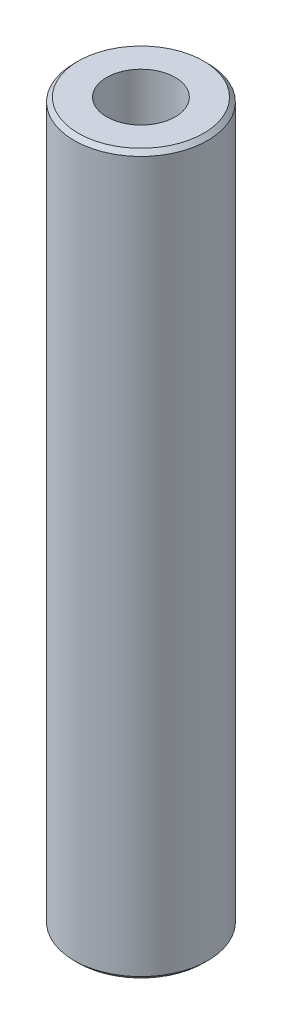
ISO-10303-21;
HEADER;
FILE_DESCRIPTION(('STEP AP214'),'2;1');
FILE_NAME('part.step','',(''),(''),'','','');
FILE_SCHEMA(('AUTOMOTIVE_DESIGN { 1 0 10303 214 1 1 1 1 }'));
ENDSEC;
DATA;
#1=APPLICATION_CONTEXT('core data for automotive mechanical design processes');
#2=APPLICATION_PROTOCOL_DEFINITION('international standard','automotive_design',2000,#1);
#3=PRODUCT_CONTEXT('',#1,'mechanical');
#4=PRODUCT('Part','Part','',(#3));
#5=PRODUCT_RELATED_PRODUCT_CATEGORY('part','',(#4));
#6=PRODUCT_DEFINITION_FORMATION('','',#4);
#7=PRODUCT_DEFINITION_CONTEXT('part definition',#1,'design');
#8=PRODUCT_DEFINITION('design','',#6,#7);
#9=PRODUCT_DEFINITION_SHAPE('','',#8);
#10=(LENGTH_UNIT() NAMED_UNIT(*) SI_UNIT(.MILLI.,.METRE.));
#11=(NAMED_UNIT(*) PLANE_ANGLE_UNIT() SI_UNIT($,.RADIAN.));
#12=(NAMED_UNIT(*) SI_UNIT($,.STERADIAN.) SOLID_ANGLE_UNIT());
#13=UNCERTAINTY_MEASURE_WITH_UNIT(LENGTH_MEASURE(1.E-05),#10,'distance_accuracy_value','');
#14=(GEOMETRIC_REPRESENTATION_CONTEXT(3) GLOBAL_UNCERTAINTY_ASSIGNED_CONTEXT((#13)) GLOBAL_UNIT_ASSIGNED_CONTEXT((#10,
#11,#12)) REPRESENTATION_CONTEXT('',''));
#15=CARTESIAN_POINT('',(0.,0.,0.));
#16=DIRECTION('',(0.,0.,1.));
#17=DIRECTION('',(1.,0.,0.));
#18=AXIS2_PLACEMENT_3D('',#15,#16,#17);
#19=CARTESIAN_POINT('',(0.,511.052478516124,0.));
#20=DIRECTION('',(0.,-1.,0.));
#21=DIRECTION('',(0.,0.,-1.));
#22=AXIS2_PLACEMENT_3D('',#19,#20,#21);
#23=CYLINDRICAL_SURFACE('',#22,47.5);
#24=CARTESIAN_POINT('',(0.,508.106633130157,0.));
#25=DIRECTION('',(0.,1.,0.));
#26=DIRECTION('',(0.,0.,1.));
#27=AXIS2_PLACEMENT_3D('',#24,#25,#26);
#28=CIRCLE('',#27,47.5);
#29=CARTESIAN_POINT('',(0.,508.106633130157,47.5));
#30=VERTEX_POINT('',#29);
#31=EDGE_CURVE('E50',#30,#30,#28,.F.);
#32=ORIENTED_EDGE('',*,*,#31,.T.);
#33=EDGE_LOOP('',(#32));
#34=FACE_BOUND('',#33,.T.);
#35=CARTESIAN_POINT('',(0.,2.94584538596721,0.));
#36=DIRECTION('',(0.,1.,0.));
#37=DIRECTION('',(0.,0.,1.));
#38=AXIS2_PLACEMENT_3D('',#35,#36,#37);
#39=CIRCLE('',#38,47.5);
#40=CARTESIAN_POINT('',(0.,2.94584538596721,47.5));
#41=VERTEX_POINT('',#40);
#42=EDGE_CURVE('E51',#41,#41,#39,.T.);
#43=ORIENTED_EDGE('',*,*,#42,.T.);
#44=EDGE_LOOP('',(#43));
#45=FACE_BOUND('',#44,.T.);
#46=ADVANCED_FACE('F39',(#34,#45),#23,.T.);
#47=CARTESIAN_POINT('',(0.,511.052478516124,0.));
#48=DIRECTION('',(0.,1.,0.));
#49=DIRECTION('',(0.,0.,1.));
#50=AXIS2_PLACEMENT_3D('',#47,#48,#49);
#51=PLANE('',#50);
#52=CARTESIAN_POINT('',(0.,511.052478516124,0.));
#53=DIRECTION('',(0.,1.,0.));
#54=DIRECTION('',(0.,0.,1.));
#55=AXIS2_PLACEMENT_3D('',#52,#53,#54);
#56=CIRCLE('',#55,44.5541546140327);
#57=CARTESIAN_POINT('',(0.,511.052478516124,44.5541546140327));
#58=VERTEX_POINT('',#57);
#59=EDGE_CURVE('E54',#58,#58,#56,.T.);
#60=ORIENTED_EDGE('',*,*,#59,.T.);
#61=EDGE_LOOP('',(#60));
#62=FACE_BOUND('',#61,.T.);
#63=CARTESIAN_POINT('',(0.,511.052478516124,0.));
#64=DIRECTION('',(0.,1.,0.));
#65=DIRECTION('',(0.,0.,1.));
#66=AXIS2_PLACEMENT_3D('',#63,#64,#65);
#67=CIRCLE('',#66,24.3593961433418);
#68=CARTESIAN_POINT('',(0.,511.052478516124,24.3593961433418));
#69=VERTEX_POINT('',#68);
#70=EDGE_CURVE('E58',#69,#69,#67,.T.);
#71=ORIENTED_EDGE('',*,*,#70,.F.);
#72=EDGE_LOOP('',(#71));
#73=FACE_BOUND('',#72,.T.);
#74=ADVANCED_FACE('F69',(#62,#73),#51,.T.);
#75=CARTESIAN_POINT('',(0.,0.,0.));
#76=DIRECTION('',(0.,1.,0.));
#77=DIRECTION('',(0.,0.,1.));
#78=AXIS2_PLACEMENT_3D('',#75,#76,#77);
#79=PLANE('',#78);
#80=CARTESIAN_POINT('',(0.,0.,0.));
#81=DIRECTION('',(0.,1.,0.));
#82=DIRECTION('',(0.,0.,1.));
#83=AXIS2_PLACEMENT_3D('',#80,#81,#82);
#84=CIRCLE('',#83,44.5541546140327);
#85=CARTESIAN_POINT('',(0.,0.,44.5541546140327));
#86=VERTEX_POINT('',#85);
#87=EDGE_CURVE('E10',#86,#86,#84,.F.);
#88=ORIENTED_EDGE('',*,*,#87,.T.);
#89=EDGE_LOOP('',(#88));
#90=FACE_BOUND('',#89,.T.);
#91=CARTESIAN_POINT('',(0.,0.,0.));
#92=DIRECTION('',(0.,1.,0.));
#93=DIRECTION('',(0.,0.,1.));
#94=AXIS2_PLACEMENT_3D('',#91,#92,#93);
#95=CIRCLE('',#94,24.3593961433418);
#96=CARTESIAN_POINT('',(0.,0.,24.3593961433418));
#97=VERTEX_POINT('',#96);
#98=EDGE_CURVE('E63',#97,#97,#95,.T.);
#99=ORIENTED_EDGE('',*,*,#98,.T.);
#100=EDGE_LOOP('',(#99));
#101=FACE_BOUND('',#100,.T.);
#102=ADVANCED_FACE('F75',(#90,#101),#79,.F.);
#103=CARTESIAN_POINT('',(0.,511.052478516124,0.));
#104=DIRECTION('',(0.,-1.,0.));
#105=DIRECTION('',(0.,0.,-1.));
#106=AXIS2_PLACEMENT_3D('',#103,#104,#105);
#107=CYLINDRICAL_SURFACE('',#106,24.3593961433418);
#108=ORIENTED_EDGE('',*,*,#70,.T.);
#109=EDGE_LOOP('',(#108));
#110=FACE_BOUND('',#109,.T.);
#111=ORIENTED_EDGE('',*,*,#98,.F.);
#112=EDGE_LOOP('',(#111));
#113=FACE_BOUND('',#112,.T.);
#114=ADVANCED_FACE('F70',(#110,#113),#107,.F.);
#115=CARTESIAN_POINT('',(0.,511.052478516124,0.));
#116=DIRECTION('',(0.,-1.,0.));
#117=DIRECTION('',(0.,0.,-1.));
#118=AXIS2_PLACEMENT_3D('',#115,#116,#117);
#119=CONICAL_SURFACE('',#118,44.5541546140327,0.785398163397442);
#120=ORIENTED_EDGE('',*,*,#31,.F.);
#121=EDGE_LOOP('',(#120));
#122=FACE_BOUND('',#121,.T.);
#123=ORIENTED_EDGE('',*,*,#59,.F.);
#124=EDGE_LOOP('',(#123));
#125=FACE_BOUND('',#124,.T.);
#126=ADVANCED_FACE('F81',(#122,#125),#119,.T.);
#127=CARTESIAN_POINT('',(0.,2.94584538596721,0.));
#128=DIRECTION('',(0.,1.,0.));
#129=DIRECTION('',(0.,0.,1.));
#130=AXIS2_PLACEMENT_3D('',#127,#128,#129);
#131=CONICAL_SURFACE('',#130,47.5,0.785398163397461);
#132=ORIENTED_EDGE('',*,*,#87,.F.);
#133=EDGE_LOOP('',(#132));
#134=FACE_BOUND('',#133,.T.);
#135=ORIENTED_EDGE('',*,*,#42,.F.);
#136=EDGE_LOOP('',(#135));
#137=FACE_BOUND('',#136,.T.);
#138=ADVANCED_FACE('F45',(#134,#137),#131,.T.);
#139=CLOSED_SHELL('',(#46,#74,#102,#114,#126,#138));
#140=MANIFOLD_SOLID_BREP('B2',#139);
#141=ADVANCED_BREP_SHAPE_REPRESENTATION('',(#18,#140),#14);
#142=SHAPE_DEFINITION_REPRESENTATION(#9,#141);
ENDSEC;
END-ISO-10303-21;
